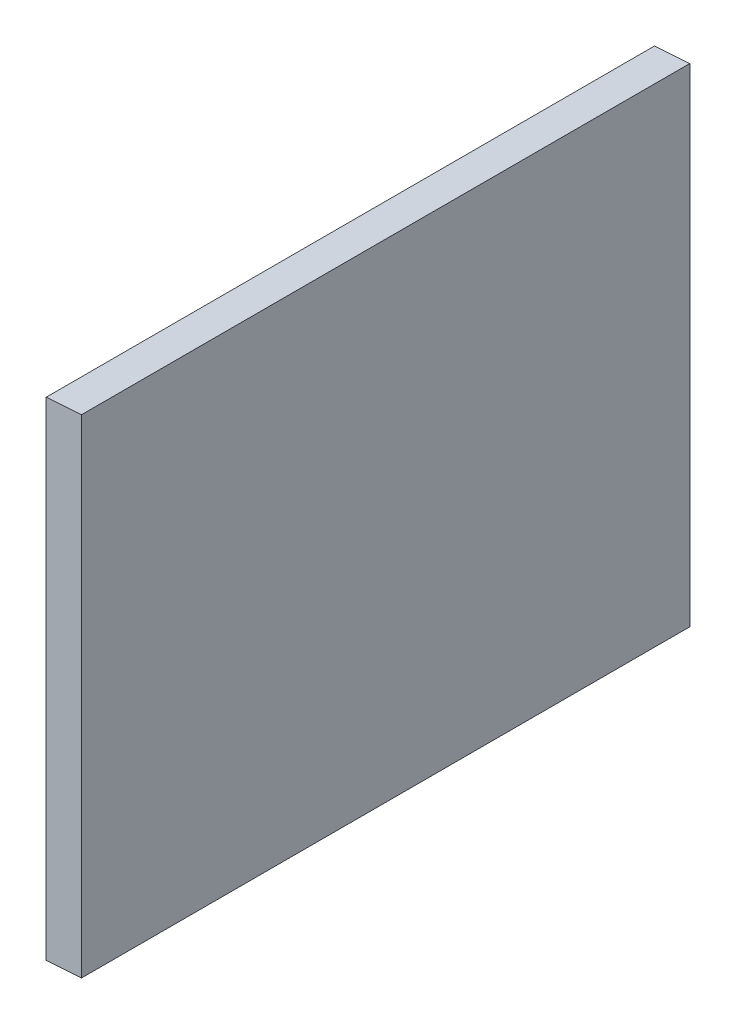
ISO-10303-21;
HEADER;
FILE_DESCRIPTION(('STEP AP214'),'2;1');
FILE_NAME('part.step','',(''),(''),'','','');
FILE_SCHEMA(('AUTOMOTIVE_DESIGN { 1 0 10303 214 1 1 1 1 }'));
ENDSEC;
DATA;
#1=APPLICATION_CONTEXT('core data for automotive mechanical design processes');
#2=APPLICATION_PROTOCOL_DEFINITION('international standard','automotive_design',2000,#1);
#3=PRODUCT_CONTEXT('',#1,'mechanical');
#4=PRODUCT('Part','Part','',(#3));
#5=PRODUCT_RELATED_PRODUCT_CATEGORY('part','',(#4));
#6=PRODUCT_DEFINITION_FORMATION('','',#4);
#7=PRODUCT_DEFINITION_CONTEXT('part definition',#1,'design');
#8=PRODUCT_DEFINITION('design','',#6,#7);
#9=PRODUCT_DEFINITION_SHAPE('','',#8);
#10=(LENGTH_UNIT() NAMED_UNIT(*) SI_UNIT(.MILLI.,.METRE.));
#11=(NAMED_UNIT(*) PLANE_ANGLE_UNIT() SI_UNIT($,.RADIAN.));
#12=(NAMED_UNIT(*) SI_UNIT($,.STERADIAN.) SOLID_ANGLE_UNIT());
#13=UNCERTAINTY_MEASURE_WITH_UNIT(LENGTH_MEASURE(1.E-05),#10,'distance_accuracy_value','');
#14=(GEOMETRIC_REPRESENTATION_CONTEXT(3) GLOBAL_UNCERTAINTY_ASSIGNED_CONTEXT((#13)) GLOBAL_UNIT_ASSIGNED_CONTEXT((#10,
#11,#12)) REPRESENTATION_CONTEXT('',''));
#15=CARTESIAN_POINT('',(0.,0.,0.));
#16=DIRECTION('',(0.,0.,1.));
#17=DIRECTION('',(1.,0.,0.));
#18=AXIS2_PLACEMENT_3D('',#15,#16,#17);
#19=CARTESIAN_POINT('',(-23.2,-1.62230203708953,400.));
#20=DIRECTION('',(-0.0697564737441292,0.997564050259824,0.));
#21=DIRECTION('',(-0.997564050259824,-0.0697564737441292,0.));
#22=AXIS2_PLACEMENT_3D('',#19,#20,#21);
#23=PLANE('',#22);
#24=DIRECTION('',(0.997564050259824,0.0697564737441292,0.));
#25=VECTOR('',#24,1.);
#26=CARTESIAN_POINT('',(-23.2,-1.62230203708953,0.));
#27=LINE('',#26,#25);
#28=CARTESIAN_POINT('',(-23.2,-1.62230203708953,0.));
#29=VERTEX_POINT('',#28);
#30=CARTESIAN_POINT('',(0.,0.,0.));
#31=VERTEX_POINT('',#30);
#32=EDGE_CURVE('E107',#29,#31,#27,.T.);
#33=ORIENTED_EDGE('',*,*,#32,.T.);
#34=DIRECTION('',(0.,0.,-1.));
#35=VECTOR('',#34,1.);
#36=CARTESIAN_POINT('',(0.,0.,400.));
#37=LINE('',#36,#35);
#38=CARTESIAN_POINT('',(0.,0.,400.));
#39=VERTEX_POINT('',#38);
#40=EDGE_CURVE('E11',#39,#31,#37,.T.);
#41=ORIENTED_EDGE('',*,*,#40,.F.);
#42=DIRECTION('',(0.997564050259824,0.0697564737441292,0.));
#43=VECTOR('',#42,1.);
#44=CARTESIAN_POINT('',(-23.2,-1.62230203708953,400.));
#45=LINE('',#44,#43);
#46=CARTESIAN_POINT('',(-23.2,-1.62230203708953,400.));
#47=VERTEX_POINT('',#46);
#48=EDGE_CURVE('E91',#47,#39,#45,.T.);
#49=ORIENTED_EDGE('',*,*,#48,.F.);
#50=DIRECTION('',(0.,0.,-1.));
#51=VECTOR('',#50,1.);
#52=CARTESIAN_POINT('',(-23.2,-1.62230203708953,400.));
#53=LINE('',#52,#51);
#54=EDGE_CURVE('E103',#47,#29,#53,.T.);
#55=ORIENTED_EDGE('',*,*,#54,.T.);
#56=EDGE_LOOP('',(#33,#41,#49,#55));
#57=FACE_BOUND('',#56,.T.);
#58=ADVANCED_FACE('F39',(#57),#23,.F.);
#59=CARTESIAN_POINT('',(0.,0.,400.));
#60=DIRECTION('',(-1.,0.,0.));
#61=DIRECTION('',(0.,0.,1.));
#62=AXIS2_PLACEMENT_3D('',#59,#60,#61);
#63=PLANE('',#62);
#64=DIRECTION('',(0.,1.,0.));
#65=VECTOR('',#64,1.);
#66=CARTESIAN_POINT('',(0.,0.,0.));
#67=LINE('',#66,#65);
#68=CARTESIAN_POINT('',(0.,320.8,0.));
#69=VERTEX_POINT('',#68);
#70=EDGE_CURVE('E96',#31,#69,#67,.T.);
#71=ORIENTED_EDGE('',*,*,#70,.T.);
#72=DIRECTION('',(0.,0.,-1.));
#73=VECTOR('',#72,1.);
#74=CARTESIAN_POINT('',(0.,320.8,400.));
#75=LINE('',#74,#73);
#76=CARTESIAN_POINT('',(0.,320.8,400.));
#77=VERTEX_POINT('',#76);
#78=EDGE_CURVE('E48',#77,#69,#75,.T.);
#79=ORIENTED_EDGE('',*,*,#78,.F.);
#80=DIRECTION('',(0.,1.,0.));
#81=VECTOR('',#80,1.);
#82=CARTESIAN_POINT('',(0.,0.,400.));
#83=LINE('',#82,#81);
#84=EDGE_CURVE('E86',#39,#77,#83,.T.);
#85=ORIENTED_EDGE('',*,*,#84,.F.);
#86=ORIENTED_EDGE('',*,*,#40,.T.);
#87=EDGE_LOOP('',(#71,#79,#85,#86));
#88=FACE_BOUND('',#87,.T.);
#89=ADVANCED_FACE('F95',(#88),#63,.F.);
#90=CARTESIAN_POINT('',(0.,320.8,400.));
#91=DIRECTION('',(0.0697564737441285,-0.997564050259824,0.));
#92=DIRECTION('',(0.997564050259824,0.0697564737441285,0.));
#93=AXIS2_PLACEMENT_3D('',#90,#91,#92);
#94=PLANE('',#93);
#95=DIRECTION('',(-0.997564050259824,-0.0697564737441285,0.));
#96=VECTOR('',#95,1.);
#97=CARTESIAN_POINT('',(0.,320.8,0.));
#98=LINE('',#97,#96);
#99=CARTESIAN_POINT('',(-23.2,319.17769796291,0.));
#100=VERTEX_POINT('',#99);
#101=EDGE_CURVE('E73',#69,#100,#98,.T.);
#102=ORIENTED_EDGE('',*,*,#101,.T.);
#103=DIRECTION('',(0.,0.,-1.));
#104=VECTOR('',#103,1.);
#105=CARTESIAN_POINT('',(-23.2,319.17769796291,400.));
#106=LINE('',#105,#104);
#107=CARTESIAN_POINT('',(-23.2,319.17769796291,400.));
#108=VERTEX_POINT('',#107);
#109=EDGE_CURVE('E98',#108,#100,#106,.T.);
#110=ORIENTED_EDGE('',*,*,#109,.F.);
#111=DIRECTION('',(-0.997564050259824,-0.0697564737441285,0.));
#112=VECTOR('',#111,1.);
#113=CARTESIAN_POINT('',(0.,320.8,400.));
#114=LINE('',#113,#112);
#115=EDGE_CURVE('E89',#77,#108,#114,.T.);
#116=ORIENTED_EDGE('',*,*,#115,.F.);
#117=ORIENTED_EDGE('',*,*,#78,.T.);
#118=EDGE_LOOP('',(#102,#110,#116,#117));
#119=FACE_BOUND('',#118,.T.);
#120=ADVANCED_FACE('F99',(#119),#94,.F.);
#121=CARTESIAN_POINT('',(-23.2,319.17769796291,400.));
#122=DIRECTION('',(1.,0.,0.));
#123=DIRECTION('',(0.,1.,0.));
#124=AXIS2_PLACEMENT_3D('',#121,#122,#123);
#125=PLANE('',#124);
#126=DIRECTION('',(0.,-1.,0.));
#127=VECTOR('',#126,1.);
#128=CARTESIAN_POINT('',(-23.2,319.17769796291,0.));
#129=LINE('',#128,#127);
#130=EDGE_CURVE('E79',#100,#29,#129,.T.);
#131=ORIENTED_EDGE('',*,*,#130,.T.);
#132=ORIENTED_EDGE('',*,*,#54,.F.);
#133=DIRECTION('',(0.,-1.,0.));
#134=VECTOR('',#133,1.);
#135=CARTESIAN_POINT('',(-23.2,319.17769796291,400.));
#136=LINE('',#135,#134);
#137=EDGE_CURVE('E56',#108,#47,#136,.T.);
#138=ORIENTED_EDGE('',*,*,#137,.F.);
#139=ORIENTED_EDGE('',*,*,#109,.T.);
#140=EDGE_LOOP('',(#131,#132,#138,#139));
#141=FACE_BOUND('',#140,.T.);
#142=ADVANCED_FACE('F120',(#141),#125,.F.);
#143=CARTESIAN_POINT('',(0.,0.,400.));
#144=DIRECTION('',(0.,0.,1.));
#145=DIRECTION('',(1.,0.,0.));
#146=AXIS2_PLACEMENT_3D('',#143,#144,#145);
#147=PLANE('',#146);
#148=ORIENTED_EDGE('',*,*,#48,.T.);
#149=ORIENTED_EDGE('',*,*,#84,.T.);
#150=ORIENTED_EDGE('',*,*,#115,.T.);
#151=ORIENTED_EDGE('',*,*,#137,.T.);
#152=EDGE_LOOP('',(#148,#149,#150,#151));
#153=FACE_BOUND('',#152,.T.);
#154=ADVANCED_FACE('F87',(#153),#147,.T.);
#155=CARTESIAN_POINT('',(0.,0.,0.));
#156=DIRECTION('',(0.,0.,1.));
#157=DIRECTION('',(1.,0.,0.));
#158=AXIS2_PLACEMENT_3D('',#155,#156,#157);
#159=PLANE('',#158);
#160=ORIENTED_EDGE('',*,*,#32,.F.);
#161=ORIENTED_EDGE('',*,*,#130,.F.);
#162=ORIENTED_EDGE('',*,*,#101,.F.);
#163=ORIENTED_EDGE('',*,*,#70,.F.);
#164=EDGE_LOOP('',(#160,#161,#162,#163));
#165=FACE_BOUND('',#164,.T.);
#166=ADVANCED_FACE('F123',(#165),#159,.F.);
#167=CLOSED_SHELL('',(#58,#89,#120,#142,#154,#166));
#168=MANIFOLD_SOLID_BREP('B2',#167);
#169=ADVANCED_BREP_SHAPE_REPRESENTATION('',(#18,#168),#14);
#170=SHAPE_DEFINITION_REPRESENTATION(#9,#169);
ENDSEC;
END-ISO-10303-21;
